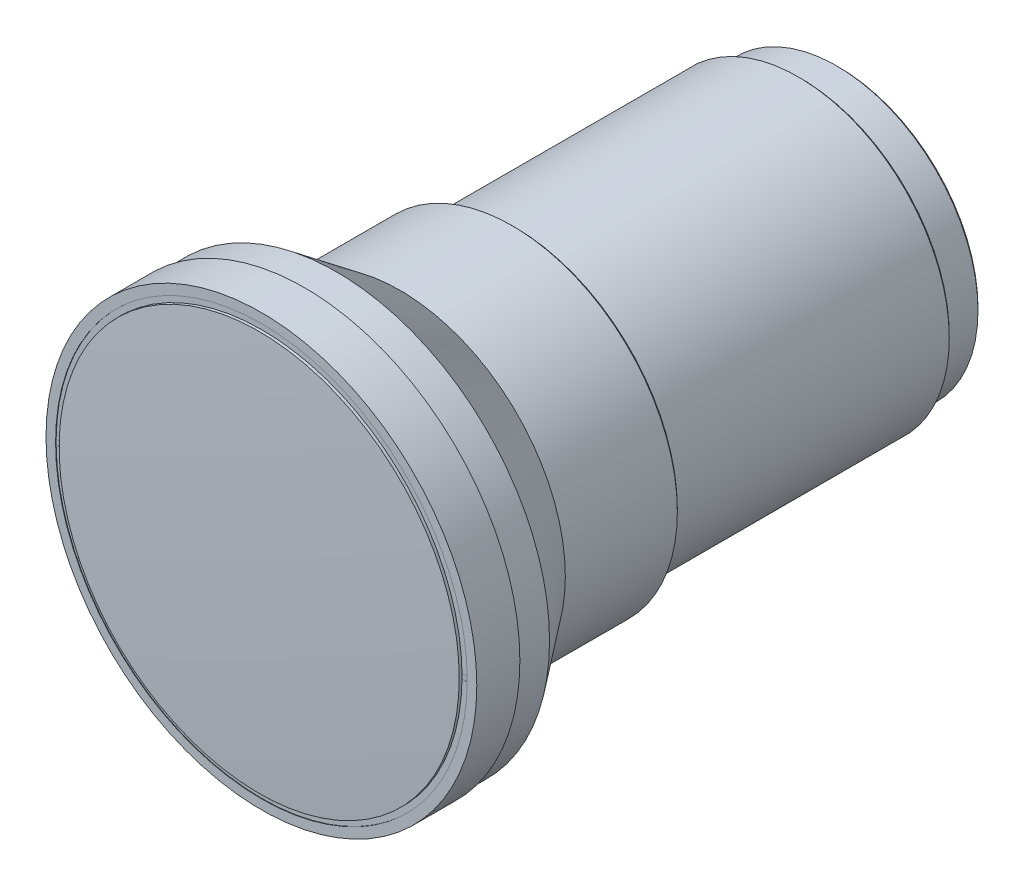
ISO-10303-21;
HEADER;
FILE_DESCRIPTION(('STEP AP214'),'2;1');
FILE_NAME('part.step','',(''),(''),'','','');
FILE_SCHEMA(('AUTOMOTIVE_DESIGN { 1 0 10303 214 1 1 1 1 }'));
ENDSEC;
DATA;
#1=APPLICATION_CONTEXT('core data for automotive mechanical design processes');
#2=APPLICATION_PROTOCOL_DEFINITION('international standard','automotive_design',2000,#1);
#3=PRODUCT_CONTEXT('',#1,'mechanical');
#4=PRODUCT('Part','Part','',(#3));
#5=PRODUCT_RELATED_PRODUCT_CATEGORY('part','',(#4));
#6=PRODUCT_DEFINITION_FORMATION('','',#4);
#7=PRODUCT_DEFINITION_CONTEXT('part definition',#1,'design');
#8=PRODUCT_DEFINITION('design','',#6,#7);
#9=PRODUCT_DEFINITION_SHAPE('','',#8);
#10=(LENGTH_UNIT() NAMED_UNIT(*) SI_UNIT(.MILLI.,.METRE.));
#11=(NAMED_UNIT(*) PLANE_ANGLE_UNIT() SI_UNIT($,.RADIAN.));
#12=(NAMED_UNIT(*) SI_UNIT($,.STERADIAN.) SOLID_ANGLE_UNIT());
#13=UNCERTAINTY_MEASURE_WITH_UNIT(LENGTH_MEASURE(1.E-05),#10,'distance_accuracy_value','');
#14=(GEOMETRIC_REPRESENTATION_CONTEXT(3) GLOBAL_UNCERTAINTY_ASSIGNED_CONTEXT((#13)) GLOBAL_UNIT_ASSIGNED_CONTEXT((#10,
#11,#12)) REPRESENTATION_CONTEXT('',''));
#15=CARTESIAN_POINT('',(0.,0.,0.));
#16=DIRECTION('',(0.,0.,1.));
#17=DIRECTION('',(1.,0.,0.));
#18=AXIS2_PLACEMENT_3D('',#15,#16,#17);
#19=CARTESIAN_POINT('',(0.,0.,-132.500000759013));
#20=DIRECTION('',(0.,0.,-1.));
#21=DIRECTION('',(-1.,0.,0.));
#22=AXIS2_PLACEMENT_3D('',#19,#20,#21);
#23=PLANE('',#22);
#24=CARTESIAN_POINT('',(-7.00743599999999,0.,-132.500000759013));
#25=CARTESIAN_POINT('',(-7.00743599999999,0.642647068935164,-132.500000759013));
#26=CARTESIAN_POINT('',(-6.89044943763556,1.27509444414275,-132.500000759013));
#27=CARTESIAN_POINT('',(-6.76653661991521,1.94498622263332,-132.500000759013));
#28=CARTESIAN_POINT('',(-6.51543201324371,2.57940011919341,-132.500000759013));
#29=CARTESIAN_POINT('',(-6.25417636667589,3.23946054155848,-132.500000759013));
#30=CARTESIAN_POINT('',(-5.86519247715198,3.83453732542217,-132.500000759013));
#31=CARTESIAN_POINT('',(-5.46845239419008,4.44147971804344,-132.500000759013));
#32=CARTESIAN_POINT('',(-4.95500551433073,4.95500551433073,-132.500000759013));
#33=CARTESIAN_POINT('',(-4.44231601562307,5.46777381305739,-132.500000759013));
#34=CARTESIAN_POINT('',(-3.83453732542217,5.86519247715198,-132.500000759013));
#35=CARTESIAN_POINT('',(-3.24039759909595,6.25369279828702,-132.500000759013));
#36=CARTESIAN_POINT('',(-2.57940011919341,6.51543201324371,-132.500000759013));
#37=CARTESIAN_POINT('',(-1.94599512081846,6.76624526452681,-132.500000759013));
#38=CARTESIAN_POINT('',(-1.27509444414275,6.89044943763556,-132.500000759013));
#39=CARTESIAN_POINT('',(-0.643443426559411,7.00738730200167,-132.500000759013));
#40=CARTESIAN_POINT('',(0.,7.00743599999999,-132.500000759013));
#41=CARTESIAN_POINT('',(0.642384233438442,7.00748461783496,-132.500000759013));
#42=CARTESIAN_POINT('',(1.27509444414275,6.89044943763556,-132.500000759013));
#43=CARTESIAN_POINT('',(1.94498622263645,6.76653661991316,-132.500000759013));
#44=CARTESIAN_POINT('',(2.57940011919341,6.51543201324371,-132.500000759013));
#45=CARTESIAN_POINT('',(3.23946054155669,6.25417636667745,-132.500000759013));
#46=CARTESIAN_POINT('',(3.83453732542216,5.86519247715198,-132.500000759013));
#47=CARTESIAN_POINT('',(4.44147971804459,5.46845239418893,-132.500000759013));
#48=CARTESIAN_POINT('',(4.95500551433073,4.95500551433073,-132.500000759013));
#49=CARTESIAN_POINT('',(5.46777381305568,4.44231601562477,-132.500000759013));
#50=CARTESIAN_POINT('',(5.86519247715198,3.83453732542216,-132.500000759013));
#51=CARTESIAN_POINT('',(6.25369279828614,3.24039759909819,-132.500000759013));
#52=CARTESIAN_POINT('',(6.51543201324371,2.57940011919341,-132.500000759013));
#53=CARTESIAN_POINT('',(6.76624526452681,1.94599512081847,-132.500000759013));
#54=CARTESIAN_POINT('',(6.89044943763556,1.27509444414275,-132.500000759013));
#55=CARTESIAN_POINT('',(7.00743599999999,0.643180379680956,-132.500000759013));
#56=CARTESIAN_POINT('',(7.00743599999999,0.,-132.500000759013));
#57=B_SPLINE_CURVE_WITH_KNOTS('',2,(#24,#25,#26,#27,#28,#29,#30,#31,#32,#33,#34,#35,#36,#37,#38,
#39,#40,#41,#42,#43,#44,#45,#46,#47,#48,#49,#50,#51,#52,#53,#54,#55,#56),.UNSPECIFIED.,.F.,.F.,
(3,2,2,2,2,2,2,2,2,2,2,2,2,2,2,2,3),(0.,0.0625,0.125,0.1875,0.25,0.3125,0.375,0.4375,0.5,0.5625,
0.625,0.6875,0.75,0.8125,0.875,0.9375,1.),.UNSPECIFIED.);
#58=CARTESIAN_POINT('',(-7.00743599999999,0.,-132.500000759013));
#59=VERTEX_POINT('',#58);
#60=CARTESIAN_POINT('',(7.00743599999999,0.,-132.500000759013));
#61=VERTEX_POINT('',#60);
#62=EDGE_CURVE('P0_E24',#59,#61,#57,.T.);
#63=ORIENTED_EDGE('',*,*,#62,.T.);
#64=CARTESIAN_POINT('',(7.00743599999999,0.,-132.500000759013));
#65=CARTESIAN_POINT('',(7.00743599999999,-0.642647068942713,-132.500000759013));
#66=CARTESIAN_POINT('',(6.89044943763556,-1.27509444414275,-132.500000759013));
#67=CARTESIAN_POINT('',(6.76653661991285,-1.9449862226381,-132.500000759013));
#68=CARTESIAN_POINT('',(6.51543201324371,-2.57940011919341,-132.500000759013));
#69=CARTESIAN_POINT('',(6.25417636667654,-3.23946054155809,-132.500000759013));
#70=CARTESIAN_POINT('',(5.86519247715198,-3.83453732542216,-132.500000759013));
#71=CARTESIAN_POINT('',(5.46845239418562,-4.44147971804965,-132.500000759013));
#72=CARTESIAN_POINT('',(4.95500551433073,-4.95500551433073,-132.500000759013));
#73=CARTESIAN_POINT('',(4.44231601561721,-5.46777381306149,-132.500000759013));
#74=CARTESIAN_POINT('',(3.83453732542217,-5.86519247715198,-132.500000759013));
#75=CARTESIAN_POINT('',(3.24039759908654,-6.25369279829291,-132.500000759013));
#76=CARTESIAN_POINT('',(2.57940011919341,-6.5154320132437,-132.500000759013));
#77=CARTESIAN_POINT('',(1.94599512080918,-6.76624526452842,-132.500000759013));
#78=CARTESIAN_POINT('',(1.27509444414275,-6.89044943763556,-132.500000759013));
#79=CARTESIAN_POINT('',(0.643443426557143,-7.0073873020022,-132.500000759013));
#80=CARTESIAN_POINT('',(0.,-7.00743599999999,-132.500000759013));
#81=CARTESIAN_POINT('',(-0.642384233438918,-7.00748461783443,-132.500000759013));
#82=CARTESIAN_POINT('',(-1.27509444414275,-6.89044943763556,-132.500000759013));
#83=CARTESIAN_POINT('',(-1.9449862226467,-6.76653661991172,-132.500000759013));
#84=CARTESIAN_POINT('',(-2.57940011919341,-6.5154320132437,-132.500000759013));
#85=CARTESIAN_POINT('',(-3.23946054156399,-6.25417636667183,-132.500000759013));
#86=CARTESIAN_POINT('',(-3.83453732542216,-5.86519247715198,-132.500000759013));
#87=CARTESIAN_POINT('',(-4.44147971804377,-5.46845239419033,-132.500000759013));
#88=CARTESIAN_POINT('',(-4.95500551433073,-4.95500551433073,-132.500000759013));
#89=CARTESIAN_POINT('',(-5.46777381305817,-4.44231601562169,-132.500000759013));
#90=CARTESIAN_POINT('',(-5.86519247715198,-3.83453732542217,-132.500000759013));
#91=CARTESIAN_POINT('',(-6.25369279829293,-3.24039759908708,-132.500000759013));
#92=CARTESIAN_POINT('',(-6.5154320132437,-2.57940011919341,-132.500000759013));
#93=CARTESIAN_POINT('',(-6.76624526452871,-1.94599512080786,-132.500000759013));
#94=CARTESIAN_POINT('',(-6.89044943763556,-1.27509444414275,-132.500000759013));
#95=CARTESIAN_POINT('',(-7.00743599999999,-0.643180379681279,-132.500000759013));
#96=CARTESIAN_POINT('',(-7.00743599999999,0.,-132.500000759013));
#97=B_SPLINE_CURVE_WITH_KNOTS('',2,(#64,#65,#66,#67,#68,#69,#70,#71,#72,#73,#74,#75,#76,#77,#78,
#79,#80,#81,#82,#83,#84,#85,#86,#87,#88,#89,#90,#91,#92,#93,#94,#95,#96),.UNSPECIFIED.,.F.,.F.,
(3,2,2,2,2,2,2,2,2,2,2,2,2,2,2,2,3),(0.,0.0625,0.125,0.1875,0.25,0.3125,0.375,0.4375,0.5,0.5625,
0.625,0.6875,0.75,0.8125,0.875,0.9375,1.),.UNSPECIFIED.);
#98=EDGE_CURVE('P0_E10',#61,#59,#97,.T.);
#99=ORIENTED_EDGE('',*,*,#98,.T.);
#100=EDGE_LOOP('',(#63,#99));
#101=FACE_BOUND('',#100,.T.);
#102=ADVANCED_FACE('P0_F17',(#101),#23,.T.);
#103=OPEN_SHELL('',(#102));
#104=SHELL_BASED_SURFACE_MODEL('P0_B1',(#103));
#105=CARTESIAN_POINT('',(0.,0.,-130.120000759013));
#106=DIRECTION('',(0.,0.,1.));
#107=DIRECTION('',(1.,0.,0.));
#108=AXIS2_PLACEMENT_3D('',#105,#106,#107);
#109=PLANE('',#108);
#110=CARTESIAN_POINT('',(0.,0.,-130.120000759013));
#111=DIRECTION('',(0.,0.,-1.));
#112=DIRECTION('',(-1.,0.,0.));
#113=AXIS2_PLACEMENT_3D('',#110,#111,#112);
#114=CIRCLE('',#113,7.65940900000002);
#115=CARTESIAN_POINT('',(-7.65940900000002,0.,-130.120000759013));
#116=VERTEX_POINT('',#115);
#117=EDGE_CURVE('P1_E18',#116,#116,#114,.T.);
#118=ORIENTED_EDGE('',*,*,#117,.F.);
#119=EDGE_LOOP('',(#118));
#120=FACE_BOUND('',#119,.T.);
#121=ADVANCED_FACE('P1_F15',(#120),#109,.T.);
#122=CARTESIAN_POINT('',(0.,0.,13.2682782608857));
#123=DIRECTION('',(0.,0.,-1.));
#124=DIRECTION('',(-1.,0.,0.));
#125=AXIS2_PLACEMENT_3D('',#122,#123,#124);
#126=CYLINDRICAL_SURFACE('',#125,7.65940900000002);
#127=ORIENTED_EDGE('',*,*,#117,.T.);
#128=EDGE_LOOP('',(#127));
#129=FACE_BOUND('',#128,.T.);
#130=CARTESIAN_POINT('',(0.,0.,-131.120000759013));
#131=DIRECTION('',(0.,0.,-1.));
#132=DIRECTION('',(-1.,0.,0.));
#133=AXIS2_PLACEMENT_3D('',#130,#131,#132);
#134=CIRCLE('',#133,7.65940900000002);
#135=CARTESIAN_POINT('',(-7.65940900000002,0.,-131.120000759013));
#136=VERTEX_POINT('',#135);
#137=EDGE_CURVE('P1_E10',#136,#136,#134,.T.);
#138=ORIENTED_EDGE('',*,*,#137,.F.);
#139=EDGE_LOOP('',(#138));
#140=FACE_BOUND('',#139,.T.);
#141=ADVANCED_FACE('P1_F27',(#129,#140),#126,.T.);
#142=CARTESIAN_POINT('',(0.,0.,-131.120000759013));
#143=DIRECTION('',(0.,0.,-1.));
#144=DIRECTION('',(-1.,0.,0.));
#145=AXIS2_PLACEMENT_3D('',#142,#143,#144);
#146=PLANE('',#145);
#147=ORIENTED_EDGE('',*,*,#137,.T.);
#148=EDGE_LOOP('',(#147));
#149=FACE_BOUND('',#148,.T.);
#150=ADVANCED_FACE('P1_F35',(#149),#146,.T.);
#151=CLOSED_SHELL('',(#121,#141,#150));
#152=MANIFOLD_SOLID_BREP('P1_B1',#151);
#153=CARTESIAN_POINT('',(0.,0.,-49.5436925124539));
#154=DIRECTION('',(0.,-1.,0.));
#155=DIRECTION('',(0.,0.,-1.));
#156=AXIS2_PLACEMENT_3D('',#153,#154,#155);
#157=SPHERICAL_SURFACE('',#156,55.1399999999998);
#158=CARTESIAN_POINT('',(0.,0.,-101.414156205811));
#159=DIRECTION('',(0.,0.,-1.));
#160=DIRECTION('',(0.,1.,0.));
#161=AXIS2_PLACEMENT_3D('',#158,#159,#160);
#162=CIRCLE('',#161,18.7049350770346);
#163=CARTESIAN_POINT('',(0.,18.7049350770346,-101.414156205811));
#164=VERTEX_POINT('',#163);
#165=EDGE_CURVE('P2_E20',#164,#164,#162,.T.);
#166=ORIENTED_EDGE('',*,*,#165,.T.);
#167=EDGE_LOOP('',(#166));
#168=FACE_BOUND('',#167,.T.);
#169=ADVANCED_FACE('P2_F16',(#168),#157,.T.);
#170=CARTESIAN_POINT('',(0.,0.,-104.827896513766));
#171=DIRECTION('',(0.,0.,-1.));
#172=DIRECTION('',(0.,1.,0.));
#173=AXIS2_PLACEMENT_3D('',#170,#171,#172);
#174=CONICAL_SURFACE('',#173,19.9392664703215,0.346951314096043);
#175=CARTESIAN_POINT('',(0.,0.,-104.827896513766));
#176=DIRECTION('',(0.,0.,-1.));
#177=DIRECTION('',(0.,1.,0.));
#178=AXIS2_PLACEMENT_3D('',#175,#176,#177);
#179=CIRCLE('',#178,19.9392664703215);
#180=CARTESIAN_POINT('',(0.,19.9392664703215,-104.827896513766));
#181=VERTEX_POINT('',#180);
#182=EDGE_CURVE('P2_E299',#181,#181,#179,.T.);
#183=ORIENTED_EDGE('',*,*,#182,.T.);
#184=EDGE_LOOP('',(#183));
#185=FACE_BOUND('',#184,.T.);
#186=ORIENTED_EDGE('',*,*,#165,.F.);
#187=EDGE_LOOP('',(#186));
#188=FACE_BOUND('',#187,.T.);
#189=ADVANCED_FACE('P2_F151',(#185,#188),#174,.F.);
#190=CARTESIAN_POINT('',(0.,21.6744625138413,-104.827896513766));
#191=DIRECTION('',(0.,0.,1.));
#192=DIRECTION('',(1.,0.,0.));
#193=AXIS2_PLACEMENT_3D('',#190,#191,#192);
#194=PLANE('',#193);
#195=ORIENTED_EDGE('',*,*,#182,.F.);
#196=EDGE_LOOP('',(#195));
#197=FACE_BOUND('',#196,.T.);
#198=CARTESIAN_POINT('',(0.,0.,-104.827896513766));
#199=DIRECTION('',(0.,0.,1.));
#200=DIRECTION('',(1.,0.,0.));
#201=AXIS2_PLACEMENT_3D('',#198,#199,#200);
#202=CIRCLE('',#201,21.6744625138413);
#203=CARTESIAN_POINT('',(21.6744625138413,0.,-104.827896513766));
#204=VERTEX_POINT('',#203);
#205=EDGE_CURVE('P2_E297',#204,#204,#202,.F.);
#206=ORIENTED_EDGE('',*,*,#205,.T.);
#207=EDGE_LOOP('',(#206));
#208=FACE_BOUND('',#207,.T.);
#209=ADVANCED_FACE('P2_F148',(#197,#208),#194,.F.);
#210=CARTESIAN_POINT('',(0.,0.,0.));
#211=DIRECTION('',(0.,0.,1.));
#212=DIRECTION('',(1.,0.,0.));
#213=AXIS2_PLACEMENT_3D('',#210,#211,#212);
#214=CYLINDRICAL_SURFACE('',#213,21.6744625138413);
#215=CARTESIAN_POINT('',(0.,0.,-105.673013439093));
#216=DIRECTION('',(0.,0.,1.));
#217=DIRECTION('',(1.,0.,0.));
#218=AXIS2_PLACEMENT_3D('',#215,#216,#217);
#219=CIRCLE('',#218,21.6744625138413);
#220=CARTESIAN_POINT('',(21.6744625138413,0.,-105.673013439093));
#221=VERTEX_POINT('',#220);
#222=EDGE_CURVE('P2_E294',#221,#221,#219,.F.);
#223=ORIENTED_EDGE('',*,*,#222,.T.);
#224=EDGE_LOOP('',(#223));
#225=FACE_BOUND('',#224,.T.);
#226=ORIENTED_EDGE('',*,*,#205,.F.);
#227=EDGE_LOOP('',(#226));
#228=FACE_BOUND('',#227,.T.);
#229=ADVANCED_FACE('P2_F144',(#225,#228),#214,.F.);
#230=CARTESIAN_POINT('',(0.,29.9396010644528,-105.673013439093));
#231=DIRECTION('',(0.,0.,1.));
#232=DIRECTION('',(1.,0.,0.));
#233=AXIS2_PLACEMENT_3D('',#230,#231,#232);
#234=PLANE('',#233);
#235=CARTESIAN_POINT('',(0.,0.,-105.673013439093));
#236=DIRECTION('',(0.,0.,1.));
#237=DIRECTION('',(1.,0.,0.));
#238=AXIS2_PLACEMENT_3D('',#235,#236,#237);
#239=CIRCLE('',#238,25.);
#240=CARTESIAN_POINT('',(25.,0.,-105.673013439093));
#241=VERTEX_POINT('',#240);
#242=EDGE_CURVE('P2_E291',#241,#241,#239,.F.);
#243=ORIENTED_EDGE('',*,*,#242,.T.);
#244=EDGE_LOOP('',(#243));
#245=FACE_BOUND('',#244,.T.);
#246=ORIENTED_EDGE('',*,*,#222,.F.);
#247=EDGE_LOOP('',(#246));
#248=FACE_BOUND('',#247,.T.);
#249=ADVANCED_FACE('P2_F140',(#245,#248),#234,.F.);
#250=CARTESIAN_POINT('',(0.,0.,0.));
#251=DIRECTION('',(0.,0.,1.));
#252=DIRECTION('',(1.,0.,0.));
#253=AXIS2_PLACEMENT_3D('',#250,#251,#252);
#254=CYLINDRICAL_SURFACE('',#253,25.);
#255=CARTESIAN_POINT('',(0.,0.,-110.210000759013));
#256=DIRECTION('',(0.,0.,1.));
#257=DIRECTION('',(1.,0.,0.));
#258=AXIS2_PLACEMENT_3D('',#255,#256,#257);
#259=CIRCLE('',#258,25.);
#260=CARTESIAN_POINT('',(25.,0.,-110.210000759013));
#261=VERTEX_POINT('',#260);
#262=EDGE_CURVE('P2_E288',#261,#261,#259,.F.);
#263=ORIENTED_EDGE('',*,*,#262,.T.);
#264=EDGE_LOOP('',(#263));
#265=FACE_BOUND('',#264,.T.);
#266=ORIENTED_EDGE('',*,*,#242,.F.);
#267=EDGE_LOOP('',(#266));
#268=FACE_BOUND('',#267,.T.);
#269=ADVANCED_FACE('P2_F136',(#265,#268),#254,.F.);
#270=CARTESIAN_POINT('',(0.,27.25,-110.210000759013));
#271=DIRECTION('',(0.,0.,1.));
#272=DIRECTION('',(1.,0.,0.));
#273=AXIS2_PLACEMENT_3D('',#270,#271,#272);
#274=PLANE('',#273);
#275=ORIENTED_EDGE('',*,*,#262,.F.);
#276=EDGE_LOOP('',(#275));
#277=FACE_BOUND('',#276,.T.);
#278=CARTESIAN_POINT('',(0.,0.,-110.210000759013));
#279=DIRECTION('',(0.,0.,1.));
#280=DIRECTION('',(1.,0.,0.));
#281=AXIS2_PLACEMENT_3D('',#278,#279,#280);
#282=CIRCLE('',#281,27.25);
#283=CARTESIAN_POINT('',(27.25,0.,-110.210000759013));
#284=VERTEX_POINT('',#283);
#285=EDGE_CURVE('P2_E113',#284,#284,#282,.F.);
#286=ORIENTED_EDGE('',*,*,#285,.T.);
#287=EDGE_LOOP('',(#286));
#288=FACE_BOUND('',#287,.T.);
#289=ADVANCED_FACE('P2_F132',(#277,#288),#274,.F.);
#290=CARTESIAN_POINT('',(0.,0.,0.));
#291=DIRECTION('',(0.,0.,1.));
#292=DIRECTION('',(1.,0.,0.));
#293=AXIS2_PLACEMENT_3D('',#290,#291,#292);
#294=CYLINDRICAL_SURFACE('',#293,27.25);
#295=CARTESIAN_POINT('',(0.,0.,-111.710000759013));
#296=DIRECTION('',(0.,0.,1.));
#297=DIRECTION('',(1.,0.,0.));
#298=AXIS2_PLACEMENT_3D('',#295,#296,#297);
#299=CIRCLE('',#298,27.25);
#300=CARTESIAN_POINT('',(27.25,0.,-111.710000759013));
#301=VERTEX_POINT('',#300);
#302=EDGE_CURVE('P2_E107',#301,#301,#299,.F.);
#303=ORIENTED_EDGE('',*,*,#302,.T.);
#304=EDGE_LOOP('',(#303));
#305=FACE_BOUND('',#304,.T.);
#306=ORIENTED_EDGE('',*,*,#285,.F.);
#307=EDGE_LOOP('',(#306));
#308=FACE_BOUND('',#307,.T.);
#309=ADVANCED_FACE('P2_F127',(#305,#308),#294,.F.);
#310=CARTESIAN_POINT('',(0.,0.,-845.));
#311=DIRECTION('',(0.,1.,0.));
#312=DIRECTION('',(0.,0.,-1.));
#313=AXIS2_PLACEMENT_3D('',#310,#311,#312);
#314=SPHERICAL_SURFACE('',#313,845.);
#315=CARTESIAN_POINT('',(0.,0.,-1.03450307491837));
#316=DIRECTION('',(0.,0.,1.));
#317=DIRECTION('',(1.,0.,0.));
#318=AXIS2_PLACEMENT_3D('',#315,#316,#317);
#319=CIRCLE('',#318,41.8);
#320=CARTESIAN_POINT('',(41.8,0.,-1.03450307491837));
#321=VERTEX_POINT('',#320);
#322=EDGE_CURVE('P2_E110',#321,#321,#319,.F.);
#323=ORIENTED_EDGE('',*,*,#322,.F.);
#324=EDGE_LOOP('',(#323));
#325=FACE_BOUND('',#324,.T.);
#326=ADVANCED_FACE('P2_F122',(#325),#314,.T.);
#327=CARTESIAN_POINT('',(0.,26.5,-111.710000759013));
#328=DIRECTION('',(0.,0.,-1.));
#329=DIRECTION('',(-1.,0.,0.));
#330=AXIS2_PLACEMENT_3D('',#327,#328,#329);
#331=PLANE('',#330);
#332=ORIENTED_EDGE('',*,*,#302,.F.);
#333=EDGE_LOOP('',(#332));
#334=FACE_BOUND('',#333,.T.);
#335=CARTESIAN_POINT('',(0.,0.,-111.710000759013));
#336=DIRECTION('',(0.,0.,1.));
#337=DIRECTION('',(1.,0.,0.));
#338=AXIS2_PLACEMENT_3D('',#335,#336,#337);
#339=CIRCLE('',#338,26.5);
#340=CARTESIAN_POINT('',(26.5,0.,-111.710000759013));
#341=VERTEX_POINT('',#340);
#342=EDGE_CURVE('P2_E282',#341,#341,#339,.F.);
#343=ORIENTED_EDGE('',*,*,#342,.T.);
#344=EDGE_LOOP('',(#343));
#345=FACE_BOUND('',#344,.T.);
#346=ADVANCED_FACE('P2_F126',(#334,#345),#331,.F.);
#347=CARTESIAN_POINT('',(0.,0.,6.70156197826717));
#348=DIRECTION('',(0.,0.,1.));
#349=DIRECTION('',(1.,0.,0.));
#350=AXIS2_PLACEMENT_3D('',#347,#348,#349);
#351=CYLINDRICAL_SURFACE('',#350,41.8);
#352=ORIENTED_EDGE('',*,*,#322,.T.);
#353=EDGE_LOOP('',(#352));
#354=FACE_BOUND('',#353,.T.);
#355=CARTESIAN_POINT('',(0.,0.,-1.61615875901295));
#356=DIRECTION('',(0.,0.,1.));
#357=DIRECTION('',(1.,0.,0.));
#358=AXIS2_PLACEMENT_3D('',#355,#356,#357);
#359=CIRCLE('',#358,41.8);
#360=CARTESIAN_POINT('',(41.7970094624005,0.500000000000007,-1.61615875901295));
#361=VERTEX_POINT('',#360);
#362=CARTESIAN_POINT('',(-41.7970094624005,0.499999999999997,-1.61615875901295));
#363=VERTEX_POINT('',#362);
#364=EDGE_CURVE('P2_E318',#361,#363,#359,.T.);
#365=ORIENTED_EDGE('',*,*,#364,.T.);
#366=DIRECTION('',(0.,0.,1.));
#367=VECTOR('',#366,1.);
#368=CARTESIAN_POINT('',(-41.7970094624005,0.499999999999996,6.70156197826717));
#369=LINE('',#368,#367);
#370=CARTESIAN_POINT('',(-41.7970094624005,0.499999999999995,-1.62394777723183));
#371=VERTEX_POINT('',#370);
#372=EDGE_CURVE('P2_E117',#363,#371,#369,.F.);
#373=ORIENTED_EDGE('',*,*,#372,.T.);
#374=CARTESIAN_POINT('',(0.,0.,-1.62394777723183));
#375=DIRECTION('',(0.,0.,1.));
#376=DIRECTION('',(1.,0.,0.));
#377=AXIS2_PLACEMENT_3D('',#374,#375,#376);
#378=CIRCLE('',#377,41.8);
#379=CARTESIAN_POINT('',(-41.7970094624005,-0.500000000000006,-1.62394777723182));
#380=VERTEX_POINT('',#379);
#381=EDGE_CURVE('P2_E106',#371,#380,#378,.T.);
#382=ORIENTED_EDGE('',*,*,#381,.T.);
#383=DIRECTION('',(0.,0.,1.));
#384=VECTOR('',#383,1.);
#385=CARTESIAN_POINT('',(-41.7970094624005,-0.500000000000004,-2.11615875901295));
#386=LINE('',#385,#384);
#387=CARTESIAN_POINT('',(-41.7970094624005,-0.500000000000006,-1.61615875901295));
#388=VERTEX_POINT('',#387);
#389=EDGE_CURVE('P2_E315',#380,#388,#386,.T.);
#390=ORIENTED_EDGE('',*,*,#389,.T.);
#391=CARTESIAN_POINT('',(0.,0.,-1.61615875901295));
#392=DIRECTION('',(0.,0.,1.));
#393=DIRECTION('',(1.,0.,0.));
#394=AXIS2_PLACEMENT_3D('',#391,#392,#393);
#395=CIRCLE('',#394,41.8);
#396=CARTESIAN_POINT('',(41.7970094624005,-0.499999999999998,-1.61615875901295));
#397=VERTEX_POINT('',#396);
#398=EDGE_CURVE('P2_E104',#388,#397,#395,.T.);
#399=ORIENTED_EDGE('',*,*,#398,.T.);
#400=DIRECTION('',(0.,0.,1.));
#401=VECTOR('',#400,1.);
#402=CARTESIAN_POINT('',(41.7970094624005,-0.500000000000002,6.70156197826717));
#403=LINE('',#402,#401);
#404=CARTESIAN_POINT('',(41.7970094624005,-0.499999999999998,-1.62394777723182));
#405=VERTEX_POINT('',#404);
#406=EDGE_CURVE('P2_E95',#397,#405,#403,.F.);
#407=ORIENTED_EDGE('',*,*,#406,.T.);
#408=CARTESIAN_POINT('',(0.,0.,-1.62394777723182));
#409=DIRECTION('',(0.,0.,1.));
#410=DIRECTION('',(1.,0.,0.));
#411=AXIS2_PLACEMENT_3D('',#408,#409,#410);
#412=CIRCLE('',#411,41.8);
#413=CARTESIAN_POINT('',(41.7970094624005,0.500000000000007,-1.62394777723183));
#414=VERTEX_POINT('',#413);
#415=EDGE_CURVE('P2_E80',#405,#414,#412,.T.);
#416=ORIENTED_EDGE('',*,*,#415,.T.);
#417=DIRECTION('',(0.,0.,1.));
#418=VECTOR('',#417,1.);
#419=CARTESIAN_POINT('',(41.7970094624005,0.500000000000007,-2.11615875901295));
#420=LINE('',#419,#418);
#421=EDGE_CURVE('P2_E99',#414,#361,#420,.T.);
#422=ORIENTED_EDGE('',*,*,#421,.T.);
#423=EDGE_LOOP('',(#365,#373,#382,#390,#399,#407,#416,#422));
#424=FACE_BOUND('',#423,.T.);
#425=ADVANCED_FACE('P2_F102',(#354,#424),#351,.T.);
#426=CARTESIAN_POINT('',(0.,0.,0.));
#427=DIRECTION('',(0.,0.,1.));
#428=DIRECTION('',(1.,0.,0.));
#429=AXIS2_PLACEMENT_3D('',#426,#427,#428);
#430=CYLINDRICAL_SURFACE('',#429,26.5);
#431=CARTESIAN_POINT('',(0.,0.,-119.210000759013));
#432=DIRECTION('',(0.,0.,1.));
#433=DIRECTION('',(1.,0.,0.));
#434=AXIS2_PLACEMENT_3D('',#431,#432,#433);
#435=CIRCLE('',#434,26.5);
#436=CARTESIAN_POINT('',(26.5,0.,-119.210000759013));
#437=VERTEX_POINT('',#436);
#438=EDGE_CURVE('P2_E321',#437,#437,#435,.F.);
#439=ORIENTED_EDGE('',*,*,#438,.T.);
#440=EDGE_LOOP('',(#439));
#441=FACE_BOUND('',#440,.T.);
#442=ORIENTED_EDGE('',*,*,#342,.F.);
#443=EDGE_LOOP('',(#442));
#444=FACE_BOUND('',#443,.T.);
#445=ADVANCED_FACE('P2_F268',(#441,#444),#430,.F.);
#446=CARTESIAN_POINT('',(57.7331284168286,-0.499999999999992,-2.11615875901295));
#447=DIRECTION('',(0.,-1.,0.));
#448=DIRECTION('',(1.,0.,0.));
#449=AXIS2_PLACEMENT_3D('',#446,#447,#448);
#450=PLANE('',#449);
#451=DIRECTION('',(0.,0.,1.));
#452=VECTOR('',#451,1.);
#453=CARTESIAN_POINT('',(-42.9970929249874,-0.499999999999989,0.));
#454=LINE('',#453,#452);
#455=CARTESIAN_POINT('',(-42.9970929249874,-0.499999999999998,-1.62394777723183));
#456=VERTEX_POINT('',#455);
#457=CARTESIAN_POINT('',(-42.9970929249874,-0.499999999999998,-1.61615875901295));
#458=VERTEX_POINT('',#457);
#459=EDGE_CURVE('P2_E324',#456,#458,#454,.T.);
#460=ORIENTED_EDGE('',*,*,#459,.T.);
#461=DIRECTION('',(-1.,0.,0.));
#462=VECTOR('',#461,1.);
#463=CARTESIAN_POINT('',(0.,-0.500000000000007,-1.61615875901295));
#464=LINE('',#463,#462);
#465=EDGE_CURVE('P2_E316',#458,#388,#464,.F.);
#466=ORIENTED_EDGE('',*,*,#465,.T.);
#467=ORIENTED_EDGE('',*,*,#389,.F.);
#468=DIRECTION('',(-1.,0.,0.));
#469=VECTOR('',#468,1.);
#470=CARTESIAN_POINT('',(0.,-0.500000000000007,-1.62394777723183));
#471=LINE('',#470,#469);
#472=EDGE_CURVE('P2_E389',#380,#456,#471,.T.);
#473=ORIENTED_EDGE('',*,*,#472,.T.);
#474=EDGE_LOOP('',(#460,#466,#467,#473));
#475=FACE_BOUND('',#474,.T.);
#476=ADVANCED_FACE('P2_F264',(#475),#450,.F.);
#477=CARTESIAN_POINT('',(0.,43.5,-1.61615875901295));
#478=DIRECTION('',(0.,0.,-1.));
#479=DIRECTION('',(-1.,0.,0.));
#480=AXIS2_PLACEMENT_3D('',#477,#478,#479);
#481=PLANE('',#480);
#482=CARTESIAN_POINT('',(0.,0.,-1.61615875901295));
#483=DIRECTION('',(0.,0.,1.));
#484=DIRECTION('',(1.,0.,0.));
#485=AXIS2_PLACEMENT_3D('',#482,#483,#484);
#486=CIRCLE('',#485,43.);
#487=CARTESIAN_POINT('',(42.9970929249874,-0.499999999999989,-1.61615875901295));
#488=VERTEX_POINT('',#487);
#489=EDGE_CURVE('P2_E326',#458,#488,#486,.T.);
#490=ORIENTED_EDGE('',*,*,#489,.T.);
#491=DIRECTION('',(1.,0.,0.));
#492=VECTOR('',#491,1.);
#493=CARTESIAN_POINT('',(57.7331284168286,-0.499999999999992,-1.61615875901295));
#494=LINE('',#493,#492);
#495=EDGE_CURVE('P2_E89',#488,#397,#494,.F.);
#496=ORIENTED_EDGE('',*,*,#495,.T.);
#497=ORIENTED_EDGE('',*,*,#398,.F.);
#498=ORIENTED_EDGE('',*,*,#465,.F.);
#499=EDGE_LOOP('',(#490,#496,#497,#498));
#500=FACE_BOUND('',#499,.T.);
#501=ADVANCED_FACE('P2_F261',(#500),#481,.F.);
#502=CARTESIAN_POINT('',(57.7331284168286,-0.499999999999992,-2.11615875901295));
#503=DIRECTION('',(0.,-1.,0.));
#504=DIRECTION('',(1.,0.,0.));
#505=AXIS2_PLACEMENT_3D('',#502,#503,#504);
#506=PLANE('',#505);
#507=DIRECTION('',(0.,0.,1.));
#508=VECTOR('',#507,1.);
#509=CARTESIAN_POINT('',(42.9970929249874,-0.499999999999985,0.));
#510=LINE('',#509,#508);
#511=CARTESIAN_POINT('',(42.9970929249874,-0.499999999999989,-1.62394777723183));
#512=VERTEX_POINT('',#511);
#513=EDGE_CURVE('P2_E98',#488,#512,#510,.F.);
#514=ORIENTED_EDGE('',*,*,#513,.T.);
#515=DIRECTION('',(-1.,0.,0.));
#516=VECTOR('',#515,1.);
#517=CARTESIAN_POINT('',(0.,-0.499999999999994,-1.62394777723183));
#518=LINE('',#517,#516);
#519=EDGE_CURVE('P2_E83',#512,#405,#518,.T.);
#520=ORIENTED_EDGE('',*,*,#519,.T.);
#521=ORIENTED_EDGE('',*,*,#406,.F.);
#522=ORIENTED_EDGE('',*,*,#495,.F.);
#523=EDGE_LOOP('',(#514,#520,#521,#522));
#524=FACE_BOUND('',#523,.T.);
#525=ADVANCED_FACE('P2_F93',(#524),#506,.F.);
#526=CARTESIAN_POINT('',(0.,41.6289368832608,-1.62394777723183));
#527=DIRECTION('',(0.,0.,-1.));
#528=DIRECTION('',(-1.,0.,0.));
#529=AXIS2_PLACEMENT_3D('',#526,#527,#528);
#530=PLANE('',#529);
#531=ORIENTED_EDGE('',*,*,#519,.F.);
#532=CARTESIAN_POINT('',(0.,0.,-1.62394777723183));
#533=DIRECTION('',(0.,0.,-1.));
#534=DIRECTION('',(-1.,0.,0.));
#535=AXIS2_PLACEMENT_3D('',#532,#533,#534);
#536=CIRCLE('',#535,43.);
#537=CARTESIAN_POINT('',(42.9970929249874,0.500000000000007,-1.62394777723183));
#538=VERTEX_POINT('',#537);
#539=EDGE_CURVE('P2_E328',#512,#538,#536,.F.);
#540=ORIENTED_EDGE('',*,*,#539,.T.);
#541=DIRECTION('',(-1.,0.,0.));
#542=VECTOR('',#541,1.);
#543=CARTESIAN_POINT('',(57.7331284168286,0.500000000000009,-1.62394777723183));
#544=LINE('',#543,#542);
#545=EDGE_CURVE('P2_E85',#538,#414,#544,.T.);
#546=ORIENTED_EDGE('',*,*,#545,.T.);
#547=ORIENTED_EDGE('',*,*,#415,.F.);
#548=EDGE_LOOP('',(#531,#540,#546,#547));
#549=FACE_BOUND('',#548,.T.);
#550=ADVANCED_FACE('P2_F82',(#549),#530,.F.);
#551=CARTESIAN_POINT('',(57.7331284168286,0.500000000000009,-2.11615875901295));
#552=DIRECTION('',(0.,1.,0.));
#553=DIRECTION('',(-1.,0.,0.));
#554=AXIS2_PLACEMENT_3D('',#551,#552,#553);
#555=PLANE('',#554);
#556=DIRECTION('',(0.,0.,1.));
#557=VECTOR('',#556,1.);
#558=CARTESIAN_POINT('',(42.9970929249874,0.500000000000006,0.));
#559=LINE('',#558,#557);
#560=CARTESIAN_POINT('',(42.9970929249874,0.500000000000007,-1.61615875901295));
#561=VERTEX_POINT('',#560);
#562=EDGE_CURVE('P2_E330',#538,#561,#559,.T.);
#563=ORIENTED_EDGE('',*,*,#562,.T.);
#564=DIRECTION('',(-1.,0.,0.));
#565=VECTOR('',#564,1.);
#566=CARTESIAN_POINT('',(0.,0.500000000000007,-1.61615875901295));
#567=LINE('',#566,#565);
#568=EDGE_CURVE('P2_E320',#561,#361,#567,.T.);
#569=ORIENTED_EDGE('',*,*,#568,.T.);
#570=ORIENTED_EDGE('',*,*,#421,.F.);
#571=ORIENTED_EDGE('',*,*,#545,.F.);
#572=EDGE_LOOP('',(#563,#569,#570,#571));
#573=FACE_BOUND('',#572,.T.);
#574=ADVANCED_FACE('P2_F252',(#573),#555,.F.);
#575=CARTESIAN_POINT('',(0.,43.5,-1.61615875901295));
#576=DIRECTION('',(0.,0.,-1.));
#577=DIRECTION('',(-1.,0.,0.));
#578=AXIS2_PLACEMENT_3D('',#575,#576,#577);
#579=PLANE('',#578);
#580=CARTESIAN_POINT('',(0.,0.,-1.61615875901295));
#581=DIRECTION('',(0.,0.,1.));
#582=DIRECTION('',(1.,0.,0.));
#583=AXIS2_PLACEMENT_3D('',#580,#581,#582);
#584=CIRCLE('',#583,43.);
#585=CARTESIAN_POINT('',(-42.9970929249874,0.499999999999995,-1.61615875901295));
#586=VERTEX_POINT('',#585);
#587=EDGE_CURVE('P2_E331',#561,#586,#584,.T.);
#588=ORIENTED_EDGE('',*,*,#587,.T.);
#589=DIRECTION('',(-1.,0.,0.));
#590=VECTOR('',#589,1.);
#591=CARTESIAN_POINT('',(57.7331284168286,0.500000000000009,-1.61615875901295));
#592=LINE('',#591,#590);
#593=EDGE_CURVE('P2_E390',#586,#363,#592,.F.);
#594=ORIENTED_EDGE('',*,*,#593,.T.);
#595=ORIENTED_EDGE('',*,*,#364,.F.);
#596=ORIENTED_EDGE('',*,*,#568,.F.);
#597=EDGE_LOOP('',(#588,#594,#595,#596));
#598=FACE_BOUND('',#597,.T.);
#599=ADVANCED_FACE('P2_F249',(#598),#579,.F.);
#600=CARTESIAN_POINT('',(57.7331284168286,0.500000000000009,-2.11615875901295));
#601=DIRECTION('',(0.,1.,0.));
#602=DIRECTION('',(-1.,0.,0.));
#603=AXIS2_PLACEMENT_3D('',#600,#601,#602);
#604=PLANE('',#603);
#605=DIRECTION('',(0.,0.,1.));
#606=VECTOR('',#605,1.);
#607=CARTESIAN_POINT('',(-42.9970929249874,0.499999999999989,0.));
#608=LINE('',#607,#606);
#609=CARTESIAN_POINT('',(-42.9970929249874,0.499999999999991,-1.62394777723183));
#610=VERTEX_POINT('',#609);
#611=EDGE_CURVE('P2_E35',#586,#610,#608,.F.);
#612=ORIENTED_EDGE('',*,*,#611,.T.);
#613=DIRECTION('',(-1.,0.,0.));
#614=VECTOR('',#613,1.);
#615=CARTESIAN_POINT('',(0.,0.499999999999994,-1.62394777723183));
#616=LINE('',#615,#614);
#617=EDGE_CURVE('P2_E325',#610,#371,#616,.F.);
#618=ORIENTED_EDGE('',*,*,#617,.T.);
#619=ORIENTED_EDGE('',*,*,#372,.F.);
#620=ORIENTED_EDGE('',*,*,#593,.F.);
#621=EDGE_LOOP('',(#612,#618,#619,#620));
#622=FACE_BOUND('',#621,.T.);
#623=ADVANCED_FACE('P2_F245',(#622),#604,.F.);
#624=CARTESIAN_POINT('',(0.,41.6289368832608,-1.62394777723183));
#625=DIRECTION('',(0.,0.,-1.));
#626=DIRECTION('',(-1.,0.,0.));
#627=AXIS2_PLACEMENT_3D('',#624,#625,#626);
#628=PLANE('',#627);
#629=CARTESIAN_POINT('',(0.,0.,-1.62394777723183));
#630=DIRECTION('',(0.,0.,-1.));
#631=DIRECTION('',(-1.,0.,0.));
#632=AXIS2_PLACEMENT_3D('',#629,#630,#631);
#633=CIRCLE('',#632,43.);
#634=EDGE_CURVE('P2_E333',#610,#456,#633,.F.);
#635=ORIENTED_EDGE('',*,*,#634,.T.);
#636=ORIENTED_EDGE('',*,*,#472,.F.);
#637=ORIENTED_EDGE('',*,*,#381,.F.);
#638=ORIENTED_EDGE('',*,*,#617,.F.);
#639=EDGE_LOOP('',(#635,#636,#637,#638));
#640=FACE_BOUND('',#639,.T.);
#641=ADVANCED_FACE('P2_F241',(#640),#628,.F.);
#642=CARTESIAN_POINT('',(0.,27.5,-119.210000759013));
#643=DIRECTION('',(0.,0.,1.));
#644=DIRECTION('',(1.,0.,0.));
#645=AXIS2_PLACEMENT_3D('',#642,#643,#644);
#646=PLANE('',#645);
#647=ORIENTED_EDGE('',*,*,#438,.F.);
#648=EDGE_LOOP('',(#647));
#649=FACE_BOUND('',#648,.T.);
#650=CARTESIAN_POINT('',(0.,0.,-119.210000759013));
#651=DIRECTION('',(0.,0.,1.));
#652=DIRECTION('',(1.,0.,0.));
#653=AXIS2_PLACEMENT_3D('',#650,#651,#652);
#654=CIRCLE('',#653,27.5);
#655=CARTESIAN_POINT('',(27.5,0.,-119.210000759013));
#656=VERTEX_POINT('',#655);
#657=EDGE_CURVE('P2_E335',#656,#656,#654,.F.);
#658=ORIENTED_EDGE('',*,*,#657,.T.);
#659=EDGE_LOOP('',(#658));
#660=FACE_BOUND('',#659,.T.);
#661=ADVANCED_FACE('P2_F237',(#649,#660),#646,.F.);
#662=CARTESIAN_POINT('',(0.,0.,0.));
#663=DIRECTION('',(0.,0.,1.));
#664=DIRECTION('',(1.,0.,0.));
#665=AXIS2_PLACEMENT_3D('',#662,#663,#664);
#666=CYLINDRICAL_SURFACE('',#665,43.);
#667=ORIENTED_EDGE('',*,*,#539,.F.);
#668=ORIENTED_EDGE('',*,*,#513,.F.);
#669=ORIENTED_EDGE('',*,*,#489,.F.);
#670=ORIENTED_EDGE('',*,*,#459,.F.);
#671=ORIENTED_EDGE('',*,*,#634,.F.);
#672=ORIENTED_EDGE('',*,*,#611,.F.);
#673=ORIENTED_EDGE('',*,*,#587,.F.);
#674=ORIENTED_EDGE('',*,*,#562,.F.);
#675=EDGE_LOOP('',(#667,#668,#669,#670,#671,#672,#673,#674));
#676=FACE_BOUND('',#675,.T.);
#677=CARTESIAN_POINT('',(0.,0.,-1.5000007590128));
#678=DIRECTION('',(0.,0.,1.));
#679=DIRECTION('',(1.,0.,0.));
#680=AXIS2_PLACEMENT_3D('',#677,#678,#679);
#681=CIRCLE('',#680,43.);
#682=CARTESIAN_POINT('',(43.,0.,-1.5000007590128));
#683=VERTEX_POINT('',#682);
#684=EDGE_CURVE('P2_E338',#683,#683,#681,.T.);
#685=ORIENTED_EDGE('',*,*,#684,.T.);
#686=EDGE_LOOP('',(#685));
#687=FACE_BOUND('',#686,.T.);
#688=ADVANCED_FACE('P2_F233',(#676,#687),#666,.F.);
#689=CARTESIAN_POINT('',(0.,0.,0.));
#690=DIRECTION('',(0.,0.,1.));
#691=DIRECTION('',(1.,0.,0.));
#692=AXIS2_PLACEMENT_3D('',#689,#690,#691);
#693=CYLINDRICAL_SURFACE('',#692,27.5);
#694=CARTESIAN_POINT('',(0.,0.,-122.210000759013));
#695=DIRECTION('',(0.,0.,1.));
#696=DIRECTION('',(1.,0.,0.));
#697=AXIS2_PLACEMENT_3D('',#694,#695,#696);
#698=CIRCLE('',#697,27.5);
#699=CARTESIAN_POINT('',(27.5,0.,-122.210000759013));
#700=VERTEX_POINT('',#699);
#701=EDGE_CURVE('P2_E341',#700,#700,#698,.F.);
#702=ORIENTED_EDGE('',*,*,#701,.T.);
#703=EDGE_LOOP('',(#702));
#704=FACE_BOUND('',#703,.T.);
#705=ORIENTED_EDGE('',*,*,#657,.F.);
#706=EDGE_LOOP('',(#705));
#707=FACE_BOUND('',#706,.T.);
#708=ADVANCED_FACE('P2_F229',(#704,#707),#693,.F.);
#709=CARTESIAN_POINT('',(0.,43.,-1.5000007590128));
#710=DIRECTION('',(0.,0.,-1.));
#711=DIRECTION('',(-1.,0.,0.));
#712=AXIS2_PLACEMENT_3D('',#709,#710,#711);
#713=PLANE('',#712);
#714=CARTESIAN_POINT('',(0.,0.,-1.5000007590128));
#715=DIRECTION('',(0.,0.,1.));
#716=DIRECTION('',(1.,0.,0.));
#717=AXIS2_PLACEMENT_3D('',#714,#715,#716);
#718=CIRCLE('',#717,45.0000000000002);
#719=CARTESIAN_POINT('',(45.0000000000002,0.,-1.5000007590128));
#720=VERTEX_POINT('',#719);
#721=EDGE_CURVE('P2_E344',#720,#720,#718,.F.);
#722=ORIENTED_EDGE('',*,*,#721,.F.);
#723=EDGE_LOOP('',(#722));
#724=FACE_BOUND('',#723,.T.);
#725=ORIENTED_EDGE('',*,*,#684,.F.);
#726=EDGE_LOOP('',(#725));
#727=FACE_BOUND('',#726,.T.);
#728=ADVANCED_FACE('P2_F225',(#724,#727),#713,.F.);
#729=CARTESIAN_POINT('',(0.,29.5,-122.210000759013));
#730=DIRECTION('',(0.,0.,1.));
#731=DIRECTION('',(1.,0.,0.));
#732=AXIS2_PLACEMENT_3D('',#729,#730,#731);
#733=PLANE('',#732);
#734=ORIENTED_EDGE('',*,*,#701,.F.);
#735=EDGE_LOOP('',(#734));
#736=FACE_BOUND('',#735,.T.);
#737=CARTESIAN_POINT('',(0.,0.,-122.210000759013));
#738=DIRECTION('',(0.,0.,1.));
#739=DIRECTION('',(1.,0.,0.));
#740=AXIS2_PLACEMENT_3D('',#737,#738,#739);
#741=CIRCLE('',#740,29.);
#742=CARTESIAN_POINT('',(29.,0.,-122.210000759013));
#743=VERTEX_POINT('',#742);
#744=EDGE_CURVE('P2_E347',#743,#743,#741,.T.);
#745=ORIENTED_EDGE('',*,*,#744,.F.);
#746=EDGE_LOOP('',(#745));
#747=FACE_BOUND('',#746,.T.);
#748=ADVANCED_FACE('P2_F221',(#736,#747),#733,.F.);
#749=CARTESIAN_POINT('',(0.,0.,0.));
#750=DIRECTION('',(0.,0.,1.));
#751=DIRECTION('',(1.,0.,0.));
#752=AXIS2_PLACEMENT_3D('',#749,#750,#751);
#753=CYLINDRICAL_SURFACE('',#752,45.0000000000002);
#754=ORIENTED_EDGE('',*,*,#721,.T.);
#755=EDGE_LOOP('',(#754));
#756=FACE_BOUND('',#755,.T.);
#757=CARTESIAN_POINT('',(0.,0.,-10.5000007590128));
#758=DIRECTION('',(0.,0.,1.));
#759=DIRECTION('',(1.,0.,0.));
#760=AXIS2_PLACEMENT_3D('',#757,#758,#759);
#761=CIRCLE('',#760,45.0000000000002);
#762=CARTESIAN_POINT('',(45.0000000000002,0.,-10.5000007590128));
#763=VERTEX_POINT('',#762);
#764=EDGE_CURVE('P2_E350',#763,#763,#761,.T.);
#765=ORIENTED_EDGE('',*,*,#764,.T.);
#766=EDGE_LOOP('',(#765));
#767=FACE_BOUND('',#766,.T.);
#768=ADVANCED_FACE('P2_F217',(#756,#767),#753,.T.);
#769=CARTESIAN_POINT('',(0.,0.,-121.710000759013));
#770=DIRECTION('',(0.,0.,1.));
#771=DIRECTION('',(1.,0.,0.));
#772=AXIS2_PLACEMENT_3D('',#769,#770,#771);
#773=CONICAL_SURFACE('',#772,29.5,0.785398163397466);
#774=CARTESIAN_POINT('',(0.,0.,-121.710000759013));
#775=DIRECTION('',(0.,0.,1.));
#776=DIRECTION('',(1.,0.,0.));
#777=AXIS2_PLACEMENT_3D('',#774,#775,#776);
#778=CIRCLE('',#777,29.5);
#779=CARTESIAN_POINT('',(29.5,0.,-121.710000759013));
#780=VERTEX_POINT('',#779);
#781=EDGE_CURVE('P2_E353',#780,#780,#778,.T.);
#782=ORIENTED_EDGE('',*,*,#781,.F.);
#783=EDGE_LOOP('',(#782));
#784=FACE_BOUND('',#783,.T.);
#785=ORIENTED_EDGE('',*,*,#744,.T.);
#786=EDGE_LOOP('',(#785));
#787=FACE_BOUND('',#786,.T.);
#788=ADVANCED_FACE('P2_F213',(#784,#787),#773,.T.);
#789=CARTESIAN_POINT('',(0.,45.0000000000002,-10.5000007590128));
#790=DIRECTION('',(0.,0.,1.));
#791=DIRECTION('',(1.,0.,0.));
#792=AXIS2_PLACEMENT_3D('',#789,#790,#791);
#793=PLANE('',#792);
#794=CARTESIAN_POINT('',(0.,0.,-10.5000007590128));
#795=DIRECTION('',(0.,0.,1.));
#796=DIRECTION('',(1.,0.,0.));
#797=AXIS2_PLACEMENT_3D('',#794,#795,#796);
#798=CIRCLE('',#797,44.5000000000002);
#799=CARTESIAN_POINT('',(44.5000000000002,0.,-10.5000007590128));
#800=VERTEX_POINT('',#799);
#801=EDGE_CURVE('P2_E354',#800,#800,#798,.F.);
#802=ORIENTED_EDGE('',*,*,#801,.F.);
#803=EDGE_LOOP('',(#802));
#804=FACE_BOUND('',#803,.T.);
#805=ORIENTED_EDGE('',*,*,#764,.F.);
#806=EDGE_LOOP('',(#805));
#807=FACE_BOUND('',#806,.T.);
#808=ADVANCED_FACE('P2_F209',(#804,#807),#793,.F.);
#809=CARTESIAN_POINT('',(0.,0.,0.));
#810=DIRECTION('',(0.,0.,1.));
#811=DIRECTION('',(1.,0.,0.));
#812=AXIS2_PLACEMENT_3D('',#809,#810,#811);
#813=CYLINDRICAL_SURFACE('',#812,29.5);
#814=CARTESIAN_POINT('',(0.,0.,-115.010000759013));
#815=DIRECTION('',(0.,0.,1.));
#816=DIRECTION('',(1.,0.,0.));
#817=AXIS2_PLACEMENT_3D('',#814,#815,#816);
#818=CIRCLE('',#817,29.5);
#819=CARTESIAN_POINT('',(29.5,0.,-115.010000759013));
#820=VERTEX_POINT('',#819);
#821=EDGE_CURVE('P2_E357',#820,#820,#818,.F.);
#822=ORIENTED_EDGE('',*,*,#821,.T.);
#823=EDGE_LOOP('',(#822));
#824=FACE_BOUND('',#823,.T.);
#825=ORIENTED_EDGE('',*,*,#781,.T.);
#826=EDGE_LOOP('',(#825));
#827=FACE_BOUND('',#826,.T.);
#828=ADVANCED_FACE('P2_F205',(#824,#827),#813,.T.);
#829=CARTESIAN_POINT('',(0.,0.,0.));
#830=DIRECTION('',(0.,0.,1.));
#831=DIRECTION('',(1.,0.,0.));
#832=AXIS2_PLACEMENT_3D('',#829,#830,#831);
#833=CYLINDRICAL_SURFACE('',#832,44.5000000000002);
#834=CARTESIAN_POINT('',(0.,0.,-17.2000007590127));
#835=DIRECTION('',(0.,0.,1.));
#836=DIRECTION('',(1.,0.,0.));
#837=AXIS2_PLACEMENT_3D('',#834,#835,#836);
#838=CIRCLE('',#837,44.5000000000002);
#839=CARTESIAN_POINT('',(44.5000000000002,0.,-17.2000007590127));
#840=VERTEX_POINT('',#839);
#841=EDGE_CURVE('P2_E360',#840,#840,#838,.F.);
#842=ORIENTED_EDGE('',*,*,#841,.F.);
#843=EDGE_LOOP('',(#842));
#844=FACE_BOUND('',#843,.T.);
#845=ORIENTED_EDGE('',*,*,#801,.T.);
#846=EDGE_LOOP('',(#845));
#847=FACE_BOUND('',#846,.T.);
#848=ADVANCED_FACE('P2_F201',(#844,#847),#833,.T.);
#849=CARTESIAN_POINT('',(0.,28.75,-115.010000759013));
#850=DIRECTION('',(0.,0.,-1.));
#851=DIRECTION('',(-1.,0.,0.));
#852=AXIS2_PLACEMENT_3D('',#849,#850,#851);
#853=PLANE('',#852);
#854=ORIENTED_EDGE('',*,*,#821,.F.);
#855=EDGE_LOOP('',(#854));
#856=FACE_BOUND('',#855,.T.);
#857=CARTESIAN_POINT('',(0.,0.,-115.010000759013));
#858=DIRECTION('',(0.,0.,1.));
#859=DIRECTION('',(1.,0.,0.));
#860=AXIS2_PLACEMENT_3D('',#857,#858,#859);
#861=CIRCLE('',#860,28.75);
#862=CARTESIAN_POINT('',(28.75,0.,-115.010000759013));
#863=VERTEX_POINT('',#862);
#864=EDGE_CURVE('P2_E361',#863,#863,#861,.T.);
#865=ORIENTED_EDGE('',*,*,#864,.F.);
#866=EDGE_LOOP('',(#865));
#867=FACE_BOUND('',#866,.T.);
#868=ADVANCED_FACE('P2_F197',(#856,#867),#853,.F.);
#869=CARTESIAN_POINT('',(0.,0.,-17.2000007590127));
#870=DIRECTION('',(0.,0.,1.));
#871=DIRECTION('',(1.,0.,0.));
#872=AXIS2_PLACEMENT_3D('',#869,#870,#871);
#873=CONICAL_SURFACE('',#872,44.5000000000002,0.644703031291437);
#874=CARTESIAN_POINT('',(0.,0.,-30.5000007590128));
#875=DIRECTION('',(0.,0.,1.));
#876=DIRECTION('',(1.,0.,0.));
#877=AXIS2_PLACEMENT_3D('',#874,#875,#876);
#878=CIRCLE('',#877,34.5000000000001);
#879=CARTESIAN_POINT('',(34.5000000000001,0.,-30.5000007590128));
#880=VERTEX_POINT('',#879);
#881=EDGE_CURVE('P2_E364',#880,#880,#878,.F.);
#882=ORIENTED_EDGE('',*,*,#881,.F.);
#883=EDGE_LOOP('',(#882));
#884=FACE_BOUND('',#883,.T.);
#885=ORIENTED_EDGE('',*,*,#841,.T.);
#886=EDGE_LOOP('',(#885));
#887=FACE_BOUND('',#886,.T.);
#888=ADVANCED_FACE('P2_F193',(#884,#887),#873,.T.);
#889=CARTESIAN_POINT('',(0.,0.,0.));
#890=DIRECTION('',(0.,0.,1.));
#891=DIRECTION('',(1.,0.,0.));
#892=AXIS2_PLACEMENT_3D('',#889,#890,#891);
#893=CYLINDRICAL_SURFACE('',#892,28.75);
#894=CARTESIAN_POINT('',(0.,0.,-114.210000759013));
#895=DIRECTION('',(0.,0.,1.));
#896=DIRECTION('',(1.,0.,0.));
#897=AXIS2_PLACEMENT_3D('',#894,#895,#896);
#898=CIRCLE('',#897,28.75);
#899=CARTESIAN_POINT('',(28.75,0.,-114.210000759013));
#900=VERTEX_POINT('',#899);
#901=EDGE_CURVE('P2_E365',#900,#900,#898,.F.);
#902=ORIENTED_EDGE('',*,*,#901,.T.);
#903=EDGE_LOOP('',(#902));
#904=FACE_BOUND('',#903,.T.);
#905=ORIENTED_EDGE('',*,*,#864,.T.);
#906=EDGE_LOOP('',(#905));
#907=FACE_BOUND('',#906,.T.);
#908=ADVANCED_FACE('P2_F189',(#904,#907),#893,.T.);
#909=CARTESIAN_POINT('',(0.,0.,0.));
#910=DIRECTION('',(0.,0.,1.));
#911=DIRECTION('',(1.,0.,0.));
#912=AXIS2_PLACEMENT_3D('',#909,#910,#911);
#913=CYLINDRICAL_SURFACE('',#912,34.5000000000001);
#914=CARTESIAN_POINT('',(0.,0.,-53.9000007590127));
#915=DIRECTION('',(0.,0.,1.));
#916=DIRECTION('',(1.,0.,0.));
#917=AXIS2_PLACEMENT_3D('',#914,#915,#916);
#918=CIRCLE('',#917,34.5000000000001);
#919=CARTESIAN_POINT('',(34.5000000000001,0.,-53.9000007590127));
#920=VERTEX_POINT('',#919);
#921=EDGE_CURVE('P2_E368',#920,#920,#918,.F.);
#922=ORIENTED_EDGE('',*,*,#921,.F.);
#923=EDGE_LOOP('',(#922));
#924=FACE_BOUND('',#923,.T.);
#925=ORIENTED_EDGE('',*,*,#881,.T.);
#926=EDGE_LOOP('',(#925));
#927=FACE_BOUND('',#926,.T.);
#928=ADVANCED_FACE('P2_F185',(#924,#927),#913,.T.);
#929=CARTESIAN_POINT('',(0.,31.5,-114.210000759013));
#930=DIRECTION('',(0.,0.,1.));
#931=DIRECTION('',(1.,0.,0.));
#932=AXIS2_PLACEMENT_3D('',#929,#930,#931);
#933=PLANE('',#932);
#934=ORIENTED_EDGE('',*,*,#901,.F.);
#935=EDGE_LOOP('',(#934));
#936=FACE_BOUND('',#935,.T.);
#937=CARTESIAN_POINT('',(0.,0.,-114.210000759013));
#938=DIRECTION('',(0.,0.,1.));
#939=DIRECTION('',(0.,-1.,0.));
#940=AXIS2_PLACEMENT_3D('',#937,#938,#939);
#941=CIRCLE('',#940,31.);
#942=CARTESIAN_POINT('',(0.,-31.,-114.210000759013));
#943=VERTEX_POINT('',#942);
#944=EDGE_CURVE('P2_E369',#943,#943,#941,.T.);
#945=ORIENTED_EDGE('',*,*,#944,.F.);
#946=EDGE_LOOP('',(#945));
#947=FACE_BOUND('',#946,.T.);
#948=ADVANCED_FACE('P2_F181',(#936,#947),#933,.F.);
#949=CARTESIAN_POINT('',(0.,0.,-53.9000007590127));
#950=DIRECTION('',(0.,0.,1.));
#951=DIRECTION('',(0.,-1.,0.));
#952=AXIS2_PLACEMENT_3D('',#949,#950,#951);
#953=CONICAL_SURFACE('',#952,34.5000000000001,0.785398163397455);
#954=CARTESIAN_POINT('',(0.,0.,-54.4000007590127));
#955=DIRECTION('',(0.,0.,1.));
#956=DIRECTION('',(0.,-1.,0.));
#957=AXIS2_PLACEMENT_3D('',#954,#955,#956);
#958=CIRCLE('',#957,34.);
#959=CARTESIAN_POINT('',(0.,-34.,-54.4000007590127));
#960=VERTEX_POINT('',#959);
#961=EDGE_CURVE('P2_E372',#960,#960,#958,.T.);
#962=ORIENTED_EDGE('',*,*,#961,.T.);
#963=EDGE_LOOP('',(#962));
#964=FACE_BOUND('',#963,.T.);
#965=ORIENTED_EDGE('',*,*,#921,.T.);
#966=EDGE_LOOP('',(#965));
#967=FACE_BOUND('',#966,.T.);
#968=ADVANCED_FACE('P2_F177',(#964,#967),#953,.T.);
#969=CARTESIAN_POINT('',(0.,0.,-113.710000759013));
#970=DIRECTION('',(0.,0.,1.));
#971=DIRECTION('',(0.,-1.,0.));
#972=AXIS2_PLACEMENT_3D('',#969,#970,#971);
#973=CONICAL_SURFACE('',#972,31.5,0.785398163397434);
#974=CARTESIAN_POINT('',(0.,0.,-113.710000759013));
#975=DIRECTION('',(0.,0.,1.));
#976=DIRECTION('',(1.,0.,0.));
#977=AXIS2_PLACEMENT_3D('',#974,#975,#976);
#978=CIRCLE('',#977,31.5);
#979=CARTESIAN_POINT('',(31.5,0.,-113.710000759013));
#980=VERTEX_POINT('',#979);
#981=EDGE_CURVE('P2_E26',#980,#980,#978,.T.);
#982=ORIENTED_EDGE('',*,*,#981,.F.);
#983=EDGE_LOOP('',(#982));
#984=FACE_BOUND('',#983,.T.);
#985=ORIENTED_EDGE('',*,*,#944,.T.);
#986=EDGE_LOOP('',(#985));
#987=FACE_BOUND('',#986,.T.);
#988=ADVANCED_FACE('P2_F170',(#984,#987),#973,.T.);
#989=CARTESIAN_POINT('',(0.,34.5000000000001,-54.4000007590127));
#990=DIRECTION('',(0.,0.,1.));
#991=DIRECTION('',(1.,0.,0.));
#992=AXIS2_PLACEMENT_3D('',#989,#990,#991);
#993=PLANE('',#992);
#994=CARTESIAN_POINT('',(0.,0.,-54.4000007590127));
#995=DIRECTION('',(0.,0.,1.));
#996=DIRECTION('',(1.,0.,0.));
#997=AXIS2_PLACEMENT_3D('',#994,#995,#996);
#998=CIRCLE('',#997,31.5);
#999=CARTESIAN_POINT('',(31.5,0.,-54.4000007590127));
#1000=VERTEX_POINT('',#999);
#1001=EDGE_CURVE('P2_E10',#1000,#1000,#998,.F.);
#1002=ORIENTED_EDGE('',*,*,#1001,.F.);
#1003=EDGE_LOOP('',(#1002));
#1004=FACE_BOUND('',#1003,.T.);
#1005=ORIENTED_EDGE('',*,*,#961,.F.);
#1006=EDGE_LOOP('',(#1005));
#1007=FACE_BOUND('',#1006,.T.);
#1008=ADVANCED_FACE('P2_F164',(#1004,#1007),#993,.F.);
#1009=CARTESIAN_POINT('',(0.,0.,0.));
#1010=DIRECTION('',(0.,0.,1.));
#1011=DIRECTION('',(1.,0.,0.));
#1012=AXIS2_PLACEMENT_3D('',#1009,#1010,#1011);
#1013=CYLINDRICAL_SURFACE('',#1012,31.5);
#1014=ORIENTED_EDGE('',*,*,#1001,.T.);
#1015=EDGE_LOOP('',(#1014));
#1016=FACE_BOUND('',#1015,.T.);
#1017=ORIENTED_EDGE('',*,*,#981,.T.);
#1018=EDGE_LOOP('',(#1017));
#1019=FACE_BOUND('',#1018,.T.);
#1020=ADVANCED_FACE('P2_F162',(#1016,#1019),#1013,.T.);
#1021=CLOSED_SHELL('',(#169,#189,#209,#229,#249,#269,#289,#309,#326,#346,#425,#445,#476,#501,
#525,#550,#574,#599,#623,#641,#661,#688,#708,#728,#748,#768,#788,#808,#828,#848,#868,#888,#908,
#928,#948,#968,#988,#1008,#1020));
#1022=MANIFOLD_SOLID_BREP('P2_B1',#1021);
#1023=ADVANCED_BREP_SHAPE_REPRESENTATION('',(#18,#152,#1022),#14);
#1024=MANIFOLD_SURFACE_SHAPE_REPRESENTATION('',(#18,#104),#14);
#1025=SHAPE_REPRESENTATION('',(#18),#14);
#1026=SHAPE_DEFINITION_REPRESENTATION(#9,#1025);
#1027=SHAPE_REPRESENTATION_RELATIONSHIP('','',#1025,#1023);
#1028=SHAPE_REPRESENTATION_RELATIONSHIP('','',#1025,#1024);
ENDSEC;
END-ISO-10303-21;
